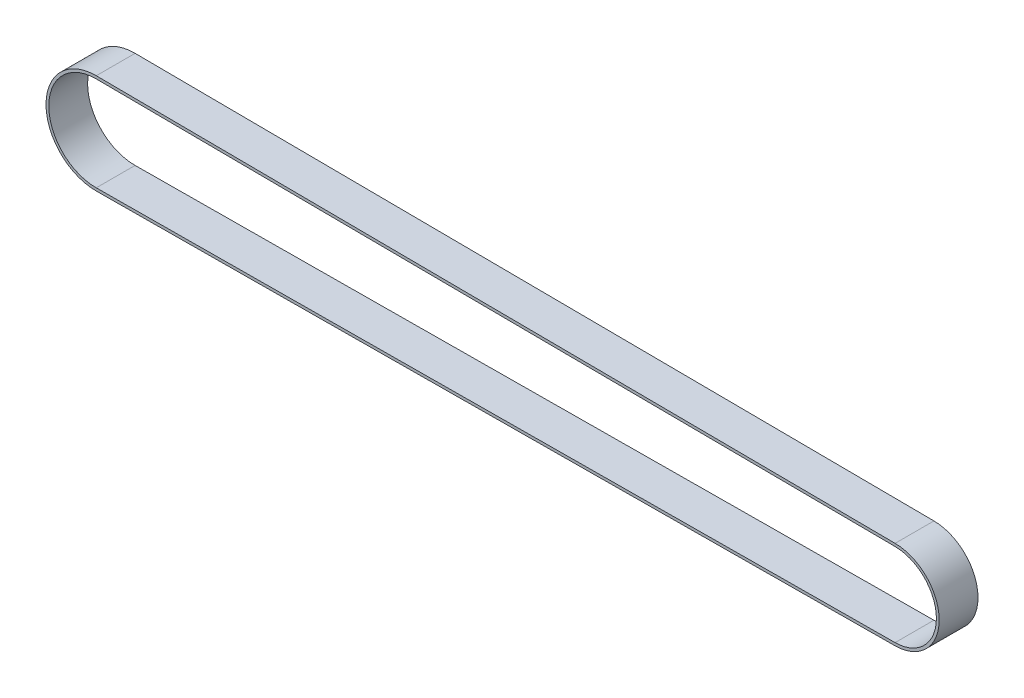
ISO-10303-21;
HEADER;
FILE_DESCRIPTION(('STEP AP214'),'2;1');
FILE_NAME('part.step','',(''),(''),'','','');
FILE_SCHEMA(('AUTOMOTIVE_DESIGN { 1 0 10303 214 1 1 1 1 }'));
ENDSEC;
DATA;
#1=APPLICATION_CONTEXT('core data for automotive mechanical design processes');
#2=APPLICATION_PROTOCOL_DEFINITION('international standard','automotive_design',2000,#1);
#3=PRODUCT_CONTEXT('',#1,'mechanical');
#4=PRODUCT('Part','Part','',(#3));
#5=PRODUCT_RELATED_PRODUCT_CATEGORY('part','',(#4));
#6=PRODUCT_DEFINITION_FORMATION('','',#4);
#7=PRODUCT_DEFINITION_CONTEXT('part definition',#1,'design');
#8=PRODUCT_DEFINITION('design','',#6,#7);
#9=PRODUCT_DEFINITION_SHAPE('','',#8);
#10=(LENGTH_UNIT() NAMED_UNIT(*) SI_UNIT(.MILLI.,.METRE.));
#11=(NAMED_UNIT(*) PLANE_ANGLE_UNIT() SI_UNIT($,.RADIAN.));
#12=(NAMED_UNIT(*) SI_UNIT($,.STERADIAN.) SOLID_ANGLE_UNIT());
#13=UNCERTAINTY_MEASURE_WITH_UNIT(LENGTH_MEASURE(1.E-05),#10,'distance_accuracy_value','');
#14=(GEOMETRIC_REPRESENTATION_CONTEXT(3) GLOBAL_UNCERTAINTY_ASSIGNED_CONTEXT((#13)) GLOBAL_UNIT_ASSIGNED_CONTEXT((#10,
#11,#12)) REPRESENTATION_CONTEXT('',''));
#15=CARTESIAN_POINT('',(0.,0.,0.));
#16=DIRECTION('',(0.,0.,1.));
#17=DIRECTION('',(1.,0.,0.));
#18=AXIS2_PLACEMENT_3D('',#15,#16,#17);
#19=CARTESIAN_POINT('',(147.,0.500000000000014,-7.));
#20=DIRECTION('',(0.,0.,1.));
#21=DIRECTION('',(1.,0.,0.));
#22=AXIS2_PLACEMENT_3D('',#19,#20,#21);
#23=CYLINDRICAL_SURFACE('',#22,8.);
#24=CARTESIAN_POINT('',(147.,0.500000000000014,0.));
#25=DIRECTION('',(0.,0.,-1.));
#26=DIRECTION('',(-1.,0.,0.));
#27=AXIS2_PLACEMENT_3D('',#24,#25,#26);
#28=CIRCLE('',#27,8.);
#29=CARTESIAN_POINT('',(147.055555555556,-7.49980709643968,0.));
#30=VERTEX_POINT('',#29);
#31=CARTESIAN_POINT('',(147.055555555556,8.49980709643971,0.));
#32=VERTEX_POINT('',#31);
#33=EDGE_CURVE('E155',#30,#32,#28,.F.);
#34=ORIENTED_EDGE('',*,*,#33,.F.);
#35=DIRECTION('',(0.,0.,1.));
#36=VECTOR('',#35,1.);
#37=CARTESIAN_POINT('',(147.055555555556,-7.49980709643968,-7.));
#38=LINE('',#37,#36);
#39=CARTESIAN_POINT('',(147.055555555556,-7.49980709643968,-7.));
#40=VERTEX_POINT('',#39);
#41=EDGE_CURVE('E12',#40,#30,#38,.T.);
#42=ORIENTED_EDGE('',*,*,#41,.F.);
#43=CARTESIAN_POINT('',(147.,0.500000000000014,-7.));
#44=DIRECTION('',(0.,0.,-1.));
#45=DIRECTION('',(-1.,0.,0.));
#46=AXIS2_PLACEMENT_3D('',#43,#44,#45);
#47=CIRCLE('',#46,8.);
#48=CARTESIAN_POINT('',(147.055555555556,8.49980709643971,-7.));
#49=VERTEX_POINT('',#48);
#50=EDGE_CURVE('E159',#40,#49,#47,.F.);
#51=ORIENTED_EDGE('',*,*,#50,.T.);
#52=DIRECTION('',(0.,0.,1.));
#53=VECTOR('',#52,1.);
#54=CARTESIAN_POINT('',(147.055555555556,8.49980709643971,-7.));
#55=LINE('',#54,#53);
#56=EDGE_CURVE('E60',#49,#32,#55,.T.);
#57=ORIENTED_EDGE('',*,*,#56,.T.);
#58=EDGE_LOOP('',(#34,#42,#51,#57));
#59=FACE_BOUND('',#58,.T.);
#60=ADVANCED_FACE('F57',(#59),#23,.T.);
#61=CARTESIAN_POINT('',(147.055555555556,-7.49980709643968,-7.));
#62=DIRECTION('',(0.00694444444444434,-0.999975887054962,0.));
#63=DIRECTION('',(0.999975887054962,0.00694444444444435,0.));
#64=AXIS2_PLACEMENT_3D('',#61,#62,#63);
#65=PLANE('',#64);
#66=DIRECTION('',(0.999975887054962,0.00694444444444434,0.));
#67=VECTOR('',#66,1.);
#68=CARTESIAN_POINT('',(147.055555555556,-7.49980709643968,0.));
#69=LINE('',#68,#67);
#70=CARTESIAN_POINT('',(3.0625,-8.49978298349463,0.));
#71=VERTEX_POINT('',#70);
#72=EDGE_CURVE('E163',#71,#30,#69,.T.);
#73=ORIENTED_EDGE('',*,*,#72,.F.);
#74=DIRECTION('',(0.,0.,1.));
#75=VECTOR('',#74,1.);
#76=CARTESIAN_POINT('',(3.0625,-8.49978298349463,-7.));
#77=LINE('',#76,#75);
#78=CARTESIAN_POINT('',(3.0625,-8.49978298349463,-7.));
#79=VERTEX_POINT('',#78);
#80=EDGE_CURVE('E65',#79,#71,#77,.T.);
#81=ORIENTED_EDGE('',*,*,#80,.F.);
#82=DIRECTION('',(0.999975887054962,0.00694444444444434,0.));
#83=VECTOR('',#82,1.);
#84=CARTESIAN_POINT('',(147.055555555556,-7.49980709643968,-7.));
#85=LINE('',#84,#83);
#86=EDGE_CURVE('E169',#79,#40,#85,.T.);
#87=ORIENTED_EDGE('',*,*,#86,.T.);
#88=ORIENTED_EDGE('',*,*,#41,.T.);
#89=EDGE_LOOP('',(#73,#81,#87,#88));
#90=FACE_BOUND('',#89,.T.);
#91=ADVANCED_FACE('F195',(#90),#65,.T.);
#92=CARTESIAN_POINT('',(3.,0.500000000000028,-7.));
#93=DIRECTION('',(0.,0.,1.));
#94=DIRECTION('',(1.,0.,0.));
#95=AXIS2_PLACEMENT_3D('',#92,#93,#94);
#96=CYLINDRICAL_SURFACE('',#95,9.);
#97=CARTESIAN_POINT('',(3.,0.500000000000028,0.));
#98=DIRECTION('',(0.,0.,-1.));
#99=DIRECTION('',(-1.,0.,0.));
#100=AXIS2_PLACEMENT_3D('',#97,#98,#99);
#101=CIRCLE('',#100,9.);
#102=CARTESIAN_POINT('',(3.0625,9.49978298349468,0.));
#103=VERTEX_POINT('',#102);
#104=EDGE_CURVE('E177',#103,#71,#101,.F.);
#105=ORIENTED_EDGE('',*,*,#104,.F.);
#106=DIRECTION('',(0.,0.,1.));
#107=VECTOR('',#106,1.);
#108=CARTESIAN_POINT('',(3.0625,9.49978298349468,-7.));
#109=LINE('',#108,#107);
#110=CARTESIAN_POINT('',(3.0625,9.49978298349468,-7.));
#111=VERTEX_POINT('',#110);
#112=EDGE_CURVE('E182',#111,#103,#109,.T.);
#113=ORIENTED_EDGE('',*,*,#112,.F.);
#114=CARTESIAN_POINT('',(3.,0.500000000000028,-7.));
#115=DIRECTION('',(0.,0.,-1.));
#116=DIRECTION('',(-1.,0.,0.));
#117=AXIS2_PLACEMENT_3D('',#114,#115,#116);
#118=CIRCLE('',#117,9.);
#119=EDGE_CURVE('E166',#111,#79,#118,.F.);
#120=ORIENTED_EDGE('',*,*,#119,.T.);
#121=ORIENTED_EDGE('',*,*,#80,.T.);
#122=EDGE_LOOP('',(#105,#113,#120,#121));
#123=FACE_BOUND('',#122,.T.);
#124=ADVANCED_FACE('F199',(#123),#96,.T.);
#125=CARTESIAN_POINT('',(147.055555555556,8.49980709643971,-7.));
#126=DIRECTION('',(0.00694444444444453,0.999975887054962,0.));
#127=DIRECTION('',(-0.999975887054962,0.00694444444444453,0.));
#128=AXIS2_PLACEMENT_3D('',#125,#126,#127);
#129=PLANE('',#128);
#130=DIRECTION('',(-0.999975887054962,0.00694444444444453,0.));
#131=VECTOR('',#130,1.);
#132=CARTESIAN_POINT('',(147.055555555556,8.49980709643971,0.));
#133=LINE('',#132,#131);
#134=EDGE_CURVE('E174',#32,#103,#133,.T.);
#135=ORIENTED_EDGE('',*,*,#134,.F.);
#136=ORIENTED_EDGE('',*,*,#56,.F.);
#137=DIRECTION('',(-0.999975887054962,0.00694444444444453,0.));
#138=VECTOR('',#137,1.);
#139=CARTESIAN_POINT('',(147.055555555556,8.49980709643971,-7.));
#140=LINE('',#139,#138);
#141=EDGE_CURVE('E162',#49,#111,#140,.T.);
#142=ORIENTED_EDGE('',*,*,#141,.T.);
#143=ORIENTED_EDGE('',*,*,#112,.T.);
#144=EDGE_LOOP('',(#135,#136,#142,#143));
#145=FACE_BOUND('',#144,.T.);
#146=ADVANCED_FACE('F190',(#145),#129,.T.);
#147=CARTESIAN_POINT('',(147.,0.500000000000014,-7.));
#148=DIRECTION('',(0.,0.,-1.));
#149=DIRECTION('',(-1.,0.,0.));
#150=AXIS2_PLACEMENT_3D('',#147,#148,#149);
#151=PLANE('',#150);
#152=CARTESIAN_POINT('',(147.,0.500000000000014,-7.));
#153=DIRECTION('',(0.,0.,1.));
#154=DIRECTION('',(-1.,0.,0.));
#155=AXIS2_PLACEMENT_3D('',#152,#153,#154);
#156=CIRCLE('',#155,7.5);
#157=CARTESIAN_POINT('',(147.052083333333,-6.9998191529122,-7.));
#158=VERTEX_POINT('',#157);
#159=CARTESIAN_POINT('',(147.052083333333,7.99981915291223,-7.));
#160=VERTEX_POINT('',#159);
#161=EDGE_CURVE('E124',#158,#160,#156,.T.);
#162=ORIENTED_EDGE('',*,*,#161,.T.);
#163=DIRECTION('',(-0.999975887054962,0.00694444444444453,0.));
#164=VECTOR('',#163,1.);
#165=CARTESIAN_POINT('',(3.05902777777778,8.99979503996721,-7.));
#166=LINE('',#165,#164);
#167=CARTESIAN_POINT('',(3.05902777777778,8.99979503996721,-7.));
#168=VERTEX_POINT('',#167);
#169=EDGE_CURVE('E133',#160,#168,#166,.T.);
#170=ORIENTED_EDGE('',*,*,#169,.T.);
#171=CARTESIAN_POINT('',(3.,0.500000000000028,-7.));
#172=DIRECTION('',(0.,0.,1.));
#173=DIRECTION('',(-1.,0.,0.));
#174=AXIS2_PLACEMENT_3D('',#171,#172,#173);
#175=CIRCLE('',#174,8.5);
#176=CARTESIAN_POINT('',(3.05902777777778,-7.99979503996715,-7.));
#177=VERTEX_POINT('',#176);
#178=EDGE_CURVE('E73',#168,#177,#175,.T.);
#179=ORIENTED_EDGE('',*,*,#178,.T.);
#180=DIRECTION('',(0.999975887054962,0.00694444444444434,0.));
#181=VECTOR('',#180,1.);
#182=CARTESIAN_POINT('',(147.052083333333,-6.9998191529122,-7.));
#183=LINE('',#182,#181);
#184=EDGE_CURVE('E130',#177,#158,#183,.T.);
#185=ORIENTED_EDGE('',*,*,#184,.T.);
#186=EDGE_LOOP('',(#162,#170,#179,#185));
#187=FACE_BOUND('',#186,.T.);
#188=ORIENTED_EDGE('',*,*,#50,.F.);
#189=ORIENTED_EDGE('',*,*,#86,.F.);
#190=ORIENTED_EDGE('',*,*,#119,.F.);
#191=ORIENTED_EDGE('',*,*,#141,.F.);
#192=EDGE_LOOP('',(#188,#189,#190,#191));
#193=FACE_BOUND('',#192,.T.);
#194=ADVANCED_FACE('F137',(#187,#193),#151,.T.);
#195=CARTESIAN_POINT('',(147.,0.500000000000014,0.));
#196=DIRECTION('',(0.,0.,-1.));
#197=DIRECTION('',(-1.,0.,0.));
#198=AXIS2_PLACEMENT_3D('',#195,#196,#197);
#199=PLANE('',#198);
#200=DIRECTION('',(-0.999975887054962,0.00694444444444453,0.));
#201=VECTOR('',#200,1.);
#202=CARTESIAN_POINT('',(3.05902777777778,8.99979503996721,0.));
#203=LINE('',#202,#201);
#204=CARTESIAN_POINT('',(147.052083333333,7.99981915291223,0.));
#205=VERTEX_POINT('',#204);
#206=CARTESIAN_POINT('',(3.05902777777778,8.99979503996721,0.));
#207=VERTEX_POINT('',#206);
#208=EDGE_CURVE('E149',#205,#207,#203,.T.);
#209=ORIENTED_EDGE('',*,*,#208,.F.);
#210=CARTESIAN_POINT('',(147.,0.500000000000014,0.));
#211=DIRECTION('',(0.,0.,1.));
#212=DIRECTION('',(-1.,0.,0.));
#213=AXIS2_PLACEMENT_3D('',#210,#211,#212);
#214=CIRCLE('',#213,7.5);
#215=CARTESIAN_POINT('',(147.052083333333,-6.9998191529122,0.));
#216=VERTEX_POINT('',#215);
#217=EDGE_CURVE('E81',#216,#205,#214,.T.);
#218=ORIENTED_EDGE('',*,*,#217,.F.);
#219=DIRECTION('',(0.999975887054962,0.00694444444444434,0.));
#220=VECTOR('',#219,1.);
#221=CARTESIAN_POINT('',(147.052083333333,-6.9998191529122,0.));
#222=LINE('',#221,#220);
#223=CARTESIAN_POINT('',(3.05902777777778,-7.99979503996715,0.));
#224=VERTEX_POINT('',#223);
#225=EDGE_CURVE('E140',#224,#216,#222,.T.);
#226=ORIENTED_EDGE('',*,*,#225,.F.);
#227=CARTESIAN_POINT('',(3.,0.500000000000028,0.));
#228=DIRECTION('',(0.,0.,1.));
#229=DIRECTION('',(-1.,0.,0.));
#230=AXIS2_PLACEMENT_3D('',#227,#228,#229);
#231=CIRCLE('',#230,8.5);
#232=EDGE_CURVE('E143',#207,#224,#231,.T.);
#233=ORIENTED_EDGE('',*,*,#232,.F.);
#234=EDGE_LOOP('',(#209,#218,#226,#233));
#235=FACE_BOUND('',#234,.T.);
#236=ORIENTED_EDGE('',*,*,#33,.T.);
#237=ORIENTED_EDGE('',*,*,#134,.T.);
#238=ORIENTED_EDGE('',*,*,#104,.T.);
#239=ORIENTED_EDGE('',*,*,#72,.T.);
#240=EDGE_LOOP('',(#236,#237,#238,#239));
#241=FACE_BOUND('',#240,.T.);
#242=ADVANCED_FACE('F192',(#235,#241),#199,.F.);
#243=CARTESIAN_POINT('',(147.,0.500000000000014,-7.));
#244=DIRECTION('',(0.,0.,1.));
#245=DIRECTION('',(1.,0.,0.));
#246=AXIS2_PLACEMENT_3D('',#243,#244,#245);
#247=CYLINDRICAL_SURFACE('',#246,7.5);
#248=ORIENTED_EDGE('',*,*,#217,.T.);
#249=DIRECTION('',(0.,0.,1.));
#250=VECTOR('',#249,1.);
#251=CARTESIAN_POINT('',(147.052083333333,7.99981915291223,-7.));
#252=LINE('',#251,#250);
#253=EDGE_CURVE('E120',#160,#205,#252,.T.);
#254=ORIENTED_EDGE('',*,*,#253,.F.);
#255=ORIENTED_EDGE('',*,*,#161,.F.);
#256=DIRECTION('',(0.,0.,1.));
#257=VECTOR('',#256,1.);
#258=CARTESIAN_POINT('',(147.052083333333,-6.9998191529122,-7.));
#259=LINE('',#258,#257);
#260=EDGE_CURVE('E153',#158,#216,#259,.T.);
#261=ORIENTED_EDGE('',*,*,#260,.T.);
#262=EDGE_LOOP('',(#248,#254,#255,#261));
#263=FACE_BOUND('',#262,.T.);
#264=ADVANCED_FACE('F122',(#263),#247,.F.);
#265=CARTESIAN_POINT('',(147.052083333333,-6.9998191529122,-7.));
#266=DIRECTION('',(0.00694444444444434,-0.999975887054962,0.));
#267=DIRECTION('',(0.999975887054962,0.00694444444444434,0.));
#268=AXIS2_PLACEMENT_3D('',#265,#266,#267);
#269=PLANE('',#268);
#270=ORIENTED_EDGE('',*,*,#225,.T.);
#271=ORIENTED_EDGE('',*,*,#260,.F.);
#272=ORIENTED_EDGE('',*,*,#184,.F.);
#273=DIRECTION('',(0.,0.,1.));
#274=VECTOR('',#273,1.);
#275=CARTESIAN_POINT('',(3.05902777777778,-7.99979503996715,-7.));
#276=LINE('',#275,#274);
#277=EDGE_CURVE('E156',#177,#224,#276,.T.);
#278=ORIENTED_EDGE('',*,*,#277,.T.);
#279=EDGE_LOOP('',(#270,#271,#272,#278));
#280=FACE_BOUND('',#279,.T.);
#281=ADVANCED_FACE('F250',(#280),#269,.F.);
#282=CARTESIAN_POINT('',(3.,0.500000000000028,-7.));
#283=DIRECTION('',(0.,0.,1.));
#284=DIRECTION('',(1.,0.,0.));
#285=AXIS2_PLACEMENT_3D('',#282,#283,#284);
#286=CYLINDRICAL_SURFACE('',#285,8.5);
#287=ORIENTED_EDGE('',*,*,#232,.T.);
#288=ORIENTED_EDGE('',*,*,#277,.F.);
#289=ORIENTED_EDGE('',*,*,#178,.F.);
#290=DIRECTION('',(0.,0.,1.));
#291=VECTOR('',#290,1.);
#292=CARTESIAN_POINT('',(3.05902777777778,8.99979503996721,-7.));
#293=LINE('',#292,#291);
#294=EDGE_CURVE('E129',#168,#207,#293,.T.);
#295=ORIENTED_EDGE('',*,*,#294,.T.);
#296=EDGE_LOOP('',(#287,#288,#289,#295));
#297=FACE_BOUND('',#296,.T.);
#298=ADVANCED_FACE('F259',(#297),#286,.F.);
#299=CARTESIAN_POINT('',(3.05902777777778,8.99979503996721,-7.));
#300=DIRECTION('',(0.00694444444444453,0.999975887054962,0.));
#301=DIRECTION('',(-0.999975887054962,0.00694444444444453,0.));
#302=AXIS2_PLACEMENT_3D('',#299,#300,#301);
#303=PLANE('',#302);
#304=ORIENTED_EDGE('',*,*,#208,.T.);
#305=ORIENTED_EDGE('',*,*,#294,.F.);
#306=ORIENTED_EDGE('',*,*,#169,.F.);
#307=ORIENTED_EDGE('',*,*,#253,.T.);
#308=EDGE_LOOP('',(#304,#305,#306,#307));
#309=FACE_BOUND('',#308,.T.);
#310=ADVANCED_FACE('F134',(#309),#303,.F.);
#311=CLOSED_SHELL('',(#60,#91,#124,#146,#194,#242,#264,#281,#298,#310));
#312=MANIFOLD_SOLID_BREP('B2',#311);
#313=ADVANCED_BREP_SHAPE_REPRESENTATION('',(#18,#312),#14);
#314=SHAPE_DEFINITION_REPRESENTATION(#9,#313);
ENDSEC;
END-ISO-10303-21;
